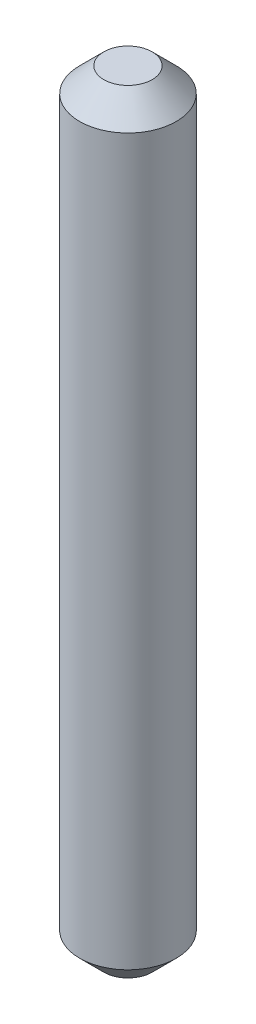
ISO-10303-21;
HEADER;
FILE_DESCRIPTION(('STEP AP214'),'2;1');
FILE_NAME('part.step','',(''),(''),'','','');
FILE_SCHEMA(('AUTOMOTIVE_DESIGN { 1 0 10303 214 1 1 1 1 }'));
ENDSEC;
DATA;
#1=APPLICATION_CONTEXT('core data for automotive mechanical design processes');
#2=APPLICATION_PROTOCOL_DEFINITION('international standard','automotive_design',2000,#1);
#3=PRODUCT_CONTEXT('',#1,'mechanical');
#4=PRODUCT('Part','Part','',(#3));
#5=PRODUCT_RELATED_PRODUCT_CATEGORY('part','',(#4));
#6=PRODUCT_DEFINITION_FORMATION('','',#4);
#7=PRODUCT_DEFINITION_CONTEXT('part definition',#1,'design');
#8=PRODUCT_DEFINITION('design','',#6,#7);
#9=PRODUCT_DEFINITION_SHAPE('','',#8);
#10=(LENGTH_UNIT() NAMED_UNIT(*) SI_UNIT(.MILLI.,.METRE.));
#11=(NAMED_UNIT(*) PLANE_ANGLE_UNIT() SI_UNIT($,.RADIAN.));
#12=(NAMED_UNIT(*) SI_UNIT($,.STERADIAN.) SOLID_ANGLE_UNIT());
#13=UNCERTAINTY_MEASURE_WITH_UNIT(LENGTH_MEASURE(1.E-05),#10,'distance_accuracy_value','');
#14=(GEOMETRIC_REPRESENTATION_CONTEXT(3) GLOBAL_UNCERTAINTY_ASSIGNED_CONTEXT((#13)) GLOBAL_UNIT_ASSIGNED_CONTEXT((#10,
#11,#12)) REPRESENTATION_CONTEXT('',''));
#15=CARTESIAN_POINT('',(0.,0.,0.));
#16=DIRECTION('',(0.,0.,1.));
#17=DIRECTION('',(1.,0.,0.));
#18=AXIS2_PLACEMENT_3D('',#15,#16,#17);
#19=CARTESIAN_POINT('',(0.,8.,0.));
#20=DIRECTION('',(0.,-1.,0.));
#21=DIRECTION('',(0.,0.,-1.));
#22=AXIS2_PLACEMENT_3D('',#19,#20,#21);
#23=CYLINDRICAL_SURFACE('',#22,0.5);
#24=CARTESIAN_POINT('',(0.,0.250000000000002,0.));
#25=DIRECTION('',(0.,1.,0.));
#26=DIRECTION('',(0.,0.,1.));
#27=AXIS2_PLACEMENT_3D('',#24,#25,#26);
#28=CIRCLE('',#27,0.5);
#29=CARTESIAN_POINT('',(0.,0.250000000000002,0.5));
#30=VERTEX_POINT('',#29);
#31=EDGE_CURVE('E40',#30,#30,#28,.T.);
#32=ORIENTED_EDGE('',*,*,#31,.T.);
#33=EDGE_LOOP('',(#32));
#34=FACE_BOUND('',#33,.T.);
#35=CARTESIAN_POINT('',(0.,7.75,0.));
#36=DIRECTION('',(0.,1.,0.));
#37=DIRECTION('',(0.,0.,1.));
#38=AXIS2_PLACEMENT_3D('',#35,#36,#37);
#39=CIRCLE('',#38,0.5);
#40=CARTESIAN_POINT('',(0.,7.75,0.5));
#41=VERTEX_POINT('',#40);
#42=EDGE_CURVE('E44',#41,#41,#39,.F.);
#43=ORIENTED_EDGE('',*,*,#42,.T.);
#44=EDGE_LOOP('',(#43));
#45=FACE_BOUND('',#44,.T.);
#46=ADVANCED_FACE('F29',(#34,#45),#23,.T.);
#47=CARTESIAN_POINT('',(0.,8.,0.));
#48=DIRECTION('',(0.,1.,0.));
#49=DIRECTION('',(0.,0.,1.));
#50=AXIS2_PLACEMENT_3D('',#47,#48,#49);
#51=PLANE('',#50);
#52=CARTESIAN_POINT('',(0.,8.,0.));
#53=DIRECTION('',(0.,1.,0.));
#54=DIRECTION('',(0.,0.,1.));
#55=AXIS2_PLACEMENT_3D('',#52,#53,#54);
#56=CIRCLE('',#55,0.250000000000002);
#57=CARTESIAN_POINT('',(0.,8.,0.250000000000002));
#58=VERTEX_POINT('',#57);
#59=EDGE_CURVE('E10',#58,#58,#56,.T.);
#60=ORIENTED_EDGE('',*,*,#59,.T.);
#61=EDGE_LOOP('',(#60));
#62=FACE_BOUND('',#61,.T.);
#63=ADVANCED_FACE('F60',(#62),#51,.T.);
#64=CARTESIAN_POINT('',(0.,0.,0.));
#65=DIRECTION('',(0.,1.,0.));
#66=DIRECTION('',(0.,0.,1.));
#67=AXIS2_PLACEMENT_3D('',#64,#65,#66);
#68=PLANE('',#67);
#69=CARTESIAN_POINT('',(0.,0.,0.));
#70=DIRECTION('',(0.,1.,0.));
#71=DIRECTION('',(0.,0.,1.));
#72=AXIS2_PLACEMENT_3D('',#69,#70,#71);
#73=CIRCLE('',#72,0.249999999999999);
#74=CARTESIAN_POINT('',(0.,0.,0.249999999999999));
#75=VERTEX_POINT('',#74);
#76=EDGE_CURVE('E36',#75,#75,#73,.F.);
#77=ORIENTED_EDGE('',*,*,#76,.T.);
#78=EDGE_LOOP('',(#77));
#79=FACE_BOUND('',#78,.T.);
#80=ADVANCED_FACE('F57',(#79),#68,.F.);
#81=CARTESIAN_POINT('',(0.,0.250000000000002,0.));
#82=DIRECTION('',(0.,1.,0.));
#83=DIRECTION('',(0.,0.,1.));
#84=AXIS2_PLACEMENT_3D('',#81,#82,#83);
#85=CONICAL_SURFACE('',#84,0.5,0.785398163397448);
#86=ORIENTED_EDGE('',*,*,#76,.F.);
#87=EDGE_LOOP('',(#86));
#88=FACE_BOUND('',#87,.T.);
#89=ORIENTED_EDGE('',*,*,#31,.F.);
#90=EDGE_LOOP('',(#89));
#91=FACE_BOUND('',#90,.T.);
#92=ADVANCED_FACE('F53',(#88,#91),#85,.T.);
#93=CARTESIAN_POINT('',(0.,8.,0.));
#94=DIRECTION('',(0.,-1.,0.));
#95=DIRECTION('',(0.,0.,-1.));
#96=AXIS2_PLACEMENT_3D('',#93,#94,#95);
#97=CONICAL_SURFACE('',#96,0.250000000000002,0.785398163397445);
#98=ORIENTED_EDGE('',*,*,#42,.F.);
#99=EDGE_LOOP('',(#98));
#100=FACE_BOUND('',#99,.T.);
#101=ORIENTED_EDGE('',*,*,#59,.F.);
#102=EDGE_LOOP('',(#101));
#103=FACE_BOUND('',#102,.T.);
#104=ADVANCED_FACE('F31',(#100,#103),#97,.T.);
#105=CLOSED_SHELL('',(#46,#63,#80,#92,#104));
#106=MANIFOLD_SOLID_BREP('B2',#105);
#107=ADVANCED_BREP_SHAPE_REPRESENTATION('',(#18,#106),#14);
#108=SHAPE_DEFINITION_REPRESENTATION(#9,#107);
ENDSEC;
END-ISO-10303-21;
